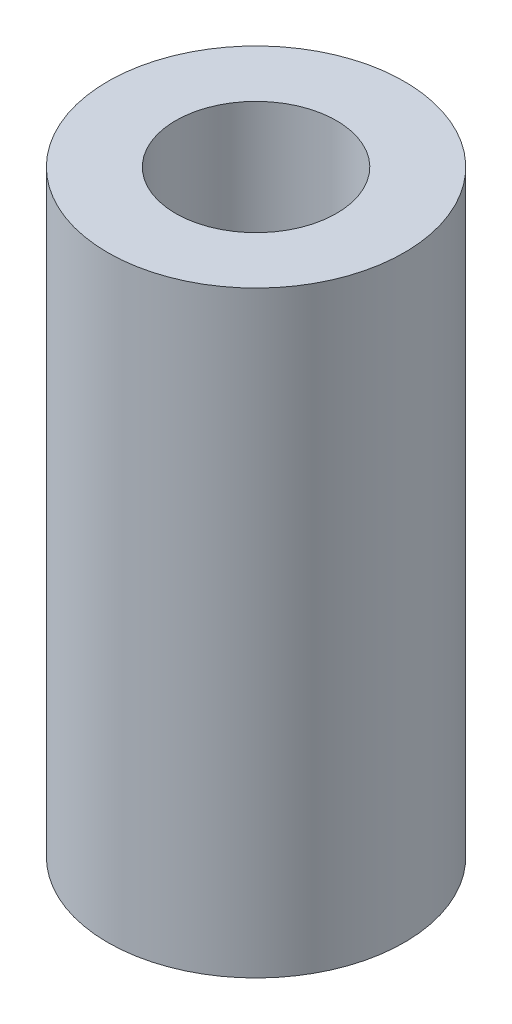
ISO-10303-21;
HEADER;
FILE_DESCRIPTION(('STEP AP214'),'2;1');
FILE_NAME('part.step','',(''),(''),'','','');
FILE_SCHEMA(('AUTOMOTIVE_DESIGN { 1 0 10303 214 1 1 1 1 }'));
ENDSEC;
DATA;
#1=APPLICATION_CONTEXT('core data for automotive mechanical design processes');
#2=APPLICATION_PROTOCOL_DEFINITION('international standard','automotive_design',2000,#1);
#3=PRODUCT_CONTEXT('',#1,'mechanical');
#4=PRODUCT('Part','Part','',(#3));
#5=PRODUCT_RELATED_PRODUCT_CATEGORY('part','',(#4));
#6=PRODUCT_DEFINITION_FORMATION('','',#4);
#7=PRODUCT_DEFINITION_CONTEXT('part definition',#1,'design');
#8=PRODUCT_DEFINITION('design','',#6,#7);
#9=PRODUCT_DEFINITION_SHAPE('','',#8);
#10=(LENGTH_UNIT() NAMED_UNIT(*) SI_UNIT(.MILLI.,.METRE.));
#11=(NAMED_UNIT(*) PLANE_ANGLE_UNIT() SI_UNIT($,.RADIAN.));
#12=(NAMED_UNIT(*) SI_UNIT($,.STERADIAN.) SOLID_ANGLE_UNIT());
#13=UNCERTAINTY_MEASURE_WITH_UNIT(LENGTH_MEASURE(1.E-05),#10,'distance_accuracy_value','');
#14=(GEOMETRIC_REPRESENTATION_CONTEXT(3) GLOBAL_UNCERTAINTY_ASSIGNED_CONTEXT((#13)) GLOBAL_UNIT_ASSIGNED_CONTEXT((#10,
#11,#12)) REPRESENTATION_CONTEXT('',''));
#15=CARTESIAN_POINT('',(0.,0.,0.));
#16=DIRECTION('',(0.,0.,1.));
#17=DIRECTION('',(1.,0.,0.));
#18=AXIS2_PLACEMENT_3D('',#15,#16,#17);
#19=CARTESIAN_POINT('',(0.,40.2899858516337,0.));
#20=DIRECTION('',(0.,-1.,0.));
#21=DIRECTION('',(0.,0.,-1.));
#22=AXIS2_PLACEMENT_3D('',#19,#20,#21);
#23=CYLINDRICAL_SURFACE('',#22,10.);
#24=CARTESIAN_POINT('',(0.,40.2899858516337,0.));
#25=DIRECTION('',(0.,1.,0.));
#26=DIRECTION('',(0.,0.,1.));
#27=AXIS2_PLACEMENT_3D('',#24,#25,#26);
#28=CIRCLE('',#27,10.);
#29=CARTESIAN_POINT('',(0.,40.2899858516337,10.));
#30=VERTEX_POINT('',#29);
#31=EDGE_CURVE('E10',#30,#30,#28,.T.);
#32=ORIENTED_EDGE('',*,*,#31,.F.);
#33=EDGE_LOOP('',(#32));
#34=FACE_BOUND('',#33,.T.);
#35=CARTESIAN_POINT('',(0.,0.,0.));
#36=DIRECTION('',(0.,1.,0.));
#37=DIRECTION('',(0.,0.,1.));
#38=AXIS2_PLACEMENT_3D('',#35,#36,#37);
#39=CIRCLE('',#38,10.);
#40=CARTESIAN_POINT('',(0.,0.,10.));
#41=VERTEX_POINT('',#40);
#42=EDGE_CURVE('E37',#41,#41,#39,.T.);
#43=ORIENTED_EDGE('',*,*,#42,.T.);
#44=EDGE_LOOP('',(#43));
#45=FACE_BOUND('',#44,.T.);
#46=ADVANCED_FACE('F40',(#34,#45),#23,.T.);
#47=CARTESIAN_POINT('',(0.,40.2899858516337,0.));
#48=DIRECTION('',(0.,1.,0.));
#49=DIRECTION('',(0.,0.,1.));
#50=AXIS2_PLACEMENT_3D('',#47,#48,#49);
#51=PLANE('',#50);
#52=CARTESIAN_POINT('',(0.,40.2899858516337,0.));
#53=DIRECTION('',(0.,1.,0.));
#54=DIRECTION('',(0.,0.,1.));
#55=AXIS2_PLACEMENT_3D('',#52,#53,#54);
#56=CIRCLE('',#55,5.4248960009171);
#57=CARTESIAN_POINT('',(0.,40.2899858516337,5.4248960009171));
#58=VERTEX_POINT('',#57);
#59=EDGE_CURVE('E50',#58,#58,#56,.T.);
#60=ORIENTED_EDGE('',*,*,#59,.F.);
#61=EDGE_LOOP('',(#60));
#62=FACE_BOUND('',#61,.T.);
#63=ORIENTED_EDGE('',*,*,#31,.T.);
#64=EDGE_LOOP('',(#63));
#65=FACE_BOUND('',#64,.T.);
#66=ADVANCED_FACE('F59',(#62,#65),#51,.T.);
#67=CARTESIAN_POINT('',(0.,0.,0.));
#68=DIRECTION('',(0.,1.,0.));
#69=DIRECTION('',(0.,0.,1.));
#70=AXIS2_PLACEMENT_3D('',#67,#68,#69);
#71=PLANE('',#70);
#72=CARTESIAN_POINT('',(0.,0.,0.));
#73=DIRECTION('',(0.,1.,0.));
#74=DIRECTION('',(0.,0.,1.));
#75=AXIS2_PLACEMENT_3D('',#72,#73,#74);
#76=CIRCLE('',#75,5.4248960009171);
#77=CARTESIAN_POINT('',(0.,0.,5.4248960009171));
#78=VERTEX_POINT('',#77);
#79=EDGE_CURVE('E47',#78,#78,#76,.T.);
#80=ORIENTED_EDGE('',*,*,#79,.T.);
#81=EDGE_LOOP('',(#80));
#82=FACE_BOUND('',#81,.T.);
#83=ORIENTED_EDGE('',*,*,#42,.F.);
#84=EDGE_LOOP('',(#83));
#85=FACE_BOUND('',#84,.T.);
#86=ADVANCED_FACE('F58',(#82,#85),#71,.F.);
#87=CARTESIAN_POINT('',(0.,40.2899858516337,0.));
#88=DIRECTION('',(0.,-1.,0.));
#89=DIRECTION('',(0.,0.,-1.));
#90=AXIS2_PLACEMENT_3D('',#87,#88,#89);
#91=CYLINDRICAL_SURFACE('',#90,5.4248960009171);
#92=ORIENTED_EDGE('',*,*,#59,.T.);
#93=EDGE_LOOP('',(#92));
#94=FACE_BOUND('',#93,.T.);
#95=ORIENTED_EDGE('',*,*,#79,.F.);
#96=EDGE_LOOP('',(#95));
#97=FACE_BOUND('',#96,.T.);
#98=ADVANCED_FACE('F54',(#94,#97),#91,.F.);
#99=CLOSED_SHELL('',(#46,#66,#86,#98));
#100=MANIFOLD_SOLID_BREP('B2',#99);
#101=ADVANCED_BREP_SHAPE_REPRESENTATION('',(#18,#100),#14);
#102=SHAPE_DEFINITION_REPRESENTATION(#9,#101);
ENDSEC;
END-ISO-10303-21;
